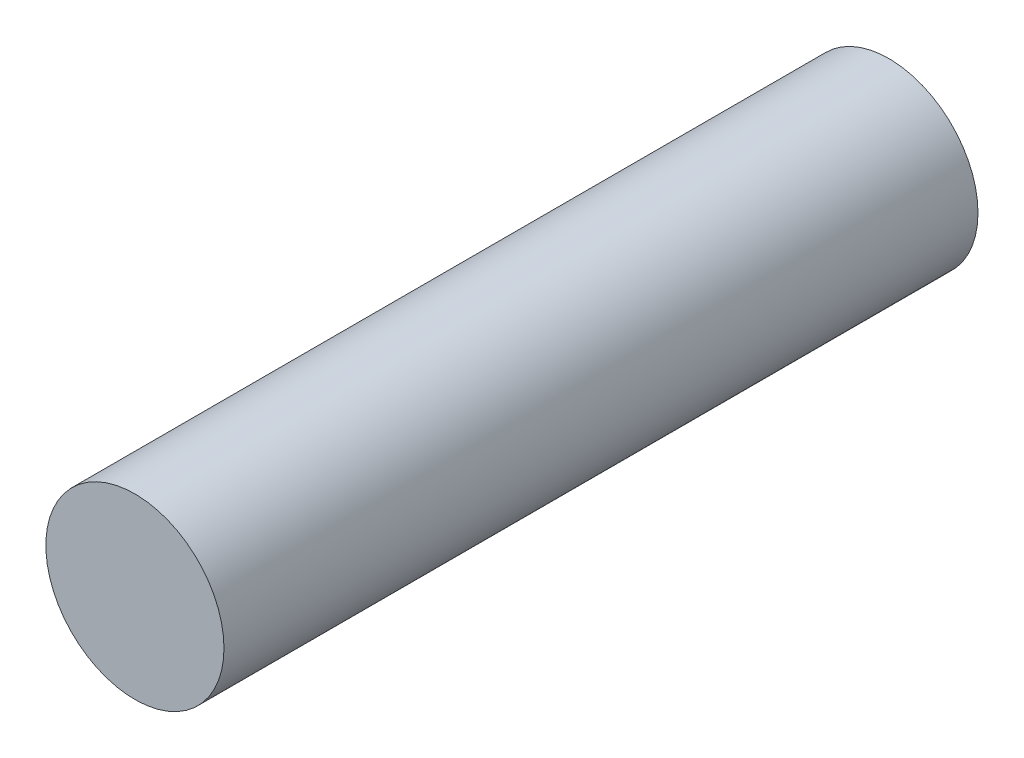
ISO-10303-21;
HEADER;
FILE_DESCRIPTION(('STEP AP214'),'2;1');
FILE_NAME('part.step','',(''),(''),'','','');
FILE_SCHEMA(('AUTOMOTIVE_DESIGN { 1 0 10303 214 1 1 1 1 }'));
ENDSEC;
DATA;
#1=APPLICATION_CONTEXT('core data for automotive mechanical design processes');
#2=APPLICATION_PROTOCOL_DEFINITION('international standard','automotive_design',2000,#1);
#3=PRODUCT_CONTEXT('',#1,'mechanical');
#4=PRODUCT('Part','Part','',(#3));
#5=PRODUCT_RELATED_PRODUCT_CATEGORY('part','',(#4));
#6=PRODUCT_DEFINITION_FORMATION('','',#4);
#7=PRODUCT_DEFINITION_CONTEXT('part definition',#1,'design');
#8=PRODUCT_DEFINITION('design','',#6,#7);
#9=PRODUCT_DEFINITION_SHAPE('','',#8);
#10=(LENGTH_UNIT() NAMED_UNIT(*) SI_UNIT(.MILLI.,.METRE.));
#11=(NAMED_UNIT(*) PLANE_ANGLE_UNIT() SI_UNIT($,.RADIAN.));
#12=(NAMED_UNIT(*) SI_UNIT($,.STERADIAN.) SOLID_ANGLE_UNIT());
#13=UNCERTAINTY_MEASURE_WITH_UNIT(LENGTH_MEASURE(1.E-05),#10,'distance_accuracy_value','');
#14=(GEOMETRIC_REPRESENTATION_CONTEXT(3) GLOBAL_UNCERTAINTY_ASSIGNED_CONTEXT((#13)) GLOBAL_UNIT_ASSIGNED_CONTEXT((#10,
#11,#12)) REPRESENTATION_CONTEXT('',''));
#15=CARTESIAN_POINT('',(0.,0.,0.));
#16=DIRECTION('',(0.,0.,1.));
#17=DIRECTION('',(1.,0.,0.));
#18=AXIS2_PLACEMENT_3D('',#15,#16,#17);
#19=CARTESIAN_POINT('',(0.,0.,43.434));
#20=DIRECTION('',(0.,0.,-1.));
#21=DIRECTION('',(-1.,0.,0.));
#22=AXIS2_PLACEMENT_3D('',#19,#20,#21);
#23=CYLINDRICAL_SURFACE('',#22,5.1308);
#24=CARTESIAN_POINT('',(0.,0.,43.434));
#25=DIRECTION('',(0.,0.,1.));
#26=DIRECTION('',(1.,0.,0.));
#27=AXIS2_PLACEMENT_3D('',#24,#25,#26);
#28=CIRCLE('',#27,5.1308);
#29=CARTESIAN_POINT('',(5.1308,0.,43.434));
#30=VERTEX_POINT('',#29);
#31=EDGE_CURVE('E10',#30,#30,#28,.T.);
#32=ORIENTED_EDGE('',*,*,#31,.F.);
#33=EDGE_LOOP('',(#32));
#34=FACE_BOUND('',#33,.T.);
#35=CARTESIAN_POINT('',(0.,0.,0.));
#36=DIRECTION('',(0.,0.,1.));
#37=DIRECTION('',(1.,0.,0.));
#38=AXIS2_PLACEMENT_3D('',#35,#36,#37);
#39=CIRCLE('',#38,5.1308);
#40=CARTESIAN_POINT('',(5.1308,0.,0.));
#41=VERTEX_POINT('',#40);
#42=EDGE_CURVE('E34',#41,#41,#39,.T.);
#43=ORIENTED_EDGE('',*,*,#42,.T.);
#44=EDGE_LOOP('',(#43));
#45=FACE_BOUND('',#44,.T.);
#46=ADVANCED_FACE('F31',(#34,#45),#23,.T.);
#47=CARTESIAN_POINT('',(0.,0.,43.434));
#48=DIRECTION('',(0.,0.,1.));
#49=DIRECTION('',(1.,0.,0.));
#50=AXIS2_PLACEMENT_3D('',#47,#48,#49);
#51=PLANE('',#50);
#52=ORIENTED_EDGE('',*,*,#31,.T.);
#53=EDGE_LOOP('',(#52));
#54=FACE_BOUND('',#53,.T.);
#55=ADVANCED_FACE('F46',(#54),#51,.T.);
#56=CARTESIAN_POINT('',(0.,0.,0.));
#57=DIRECTION('',(0.,0.,1.));
#58=DIRECTION('',(1.,0.,0.));
#59=AXIS2_PLACEMENT_3D('',#56,#57,#58);
#60=PLANE('',#59);
#61=ORIENTED_EDGE('',*,*,#42,.F.);
#62=EDGE_LOOP('',(#61));
#63=FACE_BOUND('',#62,.T.);
#64=ADVANCED_FACE('F44',(#63),#60,.F.);
#65=CLOSED_SHELL('',(#46,#55,#64));
#66=MANIFOLD_SOLID_BREP('B2',#65);
#67=ADVANCED_BREP_SHAPE_REPRESENTATION('',(#18,#66),#14);
#68=SHAPE_DEFINITION_REPRESENTATION(#9,#67);
ENDSEC;
END-ISO-10303-21;
